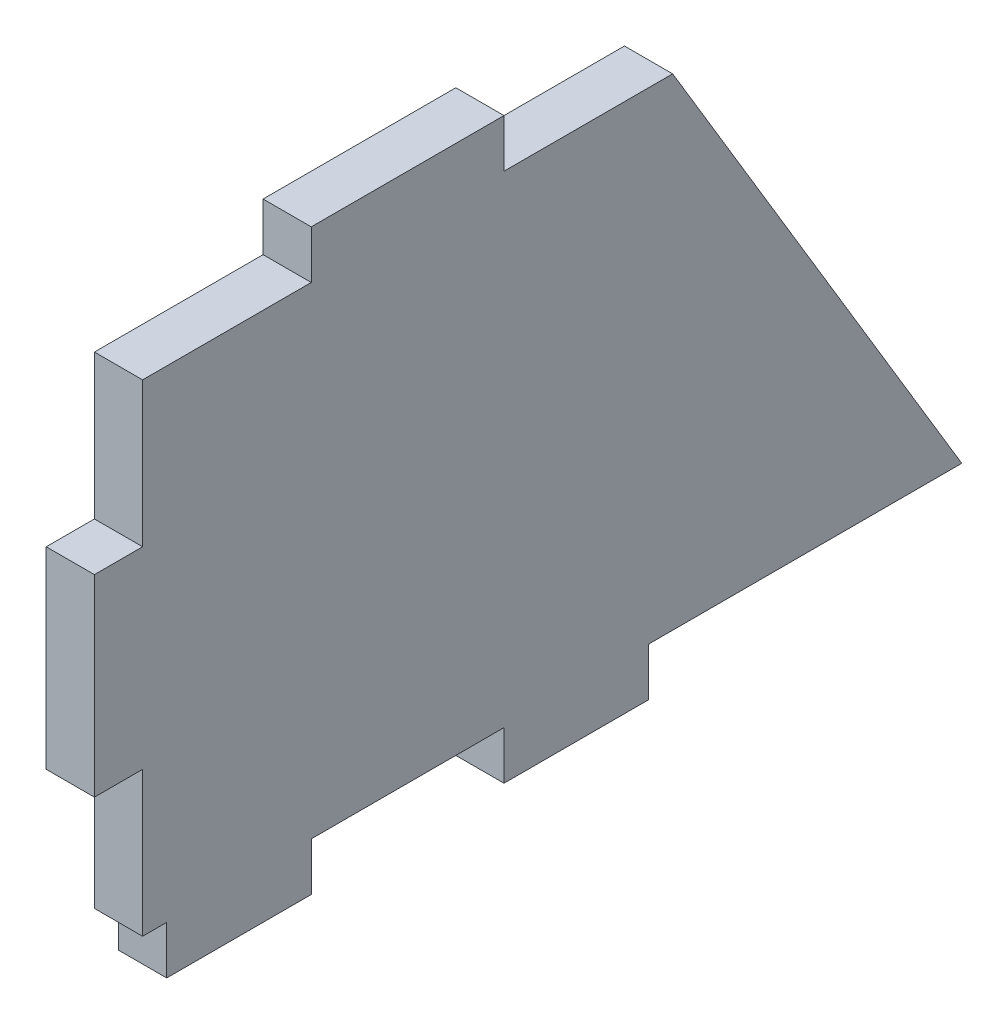
ISO-10303-21;
HEADER;
FILE_DESCRIPTION(('STEP AP214'),'2;1');
FILE_NAME('part.step','',(''),(''),'','','');
FILE_SCHEMA(('AUTOMOTIVE_DESIGN { 1 0 10303 214 1 1 1 1 }'));
ENDSEC;
DATA;
#1=APPLICATION_CONTEXT('core data for automotive mechanical design processes');
#2=APPLICATION_PROTOCOL_DEFINITION('international standard','automotive_design',2000,#1);
#3=PRODUCT_CONTEXT('',#1,'mechanical');
#4=PRODUCT('Part','Part','',(#3));
#5=PRODUCT_RELATED_PRODUCT_CATEGORY('part','',(#4));
#6=PRODUCT_DEFINITION_FORMATION('','',#4);
#7=PRODUCT_DEFINITION_CONTEXT('part definition',#1,'design');
#8=PRODUCT_DEFINITION('design','',#6,#7);
#9=PRODUCT_DEFINITION_SHAPE('','',#8);
#10=(LENGTH_UNIT() NAMED_UNIT(*) SI_UNIT(.MILLI.,.METRE.));
#11=(NAMED_UNIT(*) PLANE_ANGLE_UNIT() SI_UNIT($,.RADIAN.));
#12=(NAMED_UNIT(*) SI_UNIT($,.STERADIAN.) SOLID_ANGLE_UNIT());
#13=UNCERTAINTY_MEASURE_WITH_UNIT(LENGTH_MEASURE(1.E-05),#10,'distance_accuracy_value','');
#14=(GEOMETRIC_REPRESENTATION_CONTEXT(3) GLOBAL_UNCERTAINTY_ASSIGNED_CONTEXT((#13)) GLOBAL_UNIT_ASSIGNED_CONTEXT((#10,
#11,#12)) REPRESENTATION_CONTEXT('',''));
#15=CARTESIAN_POINT('',(0.,0.,0.));
#16=DIRECTION('',(0.,0.,1.));
#17=DIRECTION('',(1.,0.,0.));
#18=AXIS2_PLACEMENT_3D('',#15,#16,#17);
#19=CARTESIAN_POINT('',(5.,-55.,-17.5));
#20=DIRECTION('',(0.,0.,1.));
#21=DIRECTION('',(1.,0.,0.));
#22=AXIS2_PLACEMENT_3D('',#19,#20,#21);
#23=PLANE('',#22);
#24=DIRECTION('',(0.,1.,0.));
#25=VECTOR('',#24,1.);
#26=CARTESIAN_POINT('',(0.,-55.,-17.5));
#27=LINE('',#26,#25);
#28=CARTESIAN_POINT('',(0.,-55.,-17.5));
#29=VERTEX_POINT('',#28);
#30=CARTESIAN_POINT('',(0.,-50.,-17.5));
#31=VERTEX_POINT('',#30);
#32=EDGE_CURVE('E254',#29,#31,#27,.T.);
#33=ORIENTED_EDGE('',*,*,#32,.T.);
#34=DIRECTION('',(-1.,0.,0.));
#35=VECTOR('',#34,1.);
#36=CARTESIAN_POINT('',(5.,-50.,-17.5));
#37=LINE('',#36,#35);
#38=CARTESIAN_POINT('',(5.,-50.,-17.5));
#39=VERTEX_POINT('',#38);
#40=EDGE_CURVE('E11',#39,#31,#37,.T.);
#41=ORIENTED_EDGE('',*,*,#40,.F.);
#42=DIRECTION('',(0.,1.,0.));
#43=VECTOR('',#42,1.);
#44=CARTESIAN_POINT('',(5.,-55.,-17.5));
#45=LINE('',#44,#43);
#46=CARTESIAN_POINT('',(5.,-55.,-17.5));
#47=VERTEX_POINT('',#46);
#48=EDGE_CURVE('E312',#47,#39,#45,.T.);
#49=ORIENTED_EDGE('',*,*,#48,.F.);
#50=DIRECTION('',(-1.,0.,0.));
#51=VECTOR('',#50,1.);
#52=CARTESIAN_POINT('',(5.,-55.,-17.5));
#53=LINE('',#52,#51);
#54=EDGE_CURVE('E250',#47,#29,#53,.T.);
#55=ORIENTED_EDGE('',*,*,#54,.T.);
#56=EDGE_LOOP('',(#33,#41,#49,#55));
#57=FACE_BOUND('',#56,.T.);
#58=ADVANCED_FACE('F41',(#57),#23,.F.);
#59=CARTESIAN_POINT('',(5.,-50.,-17.5));
#60=DIRECTION('',(0.,1.,0.));
#61=DIRECTION('',(0.,0.,1.));
#62=AXIS2_PLACEMENT_3D('',#59,#60,#61);
#63=PLANE('',#62);
#64=DIRECTION('',(0.,0.,-1.));
#65=VECTOR('',#64,1.);
#66=CARTESIAN_POINT('',(0.,-50.,-17.5));
#67=LINE('',#66,#65);
#68=CARTESIAN_POINT('',(0.,-50.,-37.5));
#69=VERTEX_POINT('',#68);
#70=EDGE_CURVE('E258',#31,#69,#67,.T.);
#71=ORIENTED_EDGE('',*,*,#70,.T.);
#72=DIRECTION('',(-1.,0.,0.));
#73=VECTOR('',#72,1.);
#74=CARTESIAN_POINT('',(5.,-50.,-37.5));
#75=LINE('',#74,#73);
#76=CARTESIAN_POINT('',(5.,-50.,-37.5));
#77=VERTEX_POINT('',#76);
#78=EDGE_CURVE('E50',#77,#69,#75,.T.);
#79=ORIENTED_EDGE('',*,*,#78,.F.);
#80=DIRECTION('',(0.,0.,-1.));
#81=VECTOR('',#80,1.);
#82=CARTESIAN_POINT('',(5.,-50.,-17.5));
#83=LINE('',#82,#81);
#84=EDGE_CURVE('E161',#39,#77,#83,.T.);
#85=ORIENTED_EDGE('',*,*,#84,.F.);
#86=ORIENTED_EDGE('',*,*,#40,.T.);
#87=EDGE_LOOP('',(#71,#79,#85,#86));
#88=FACE_BOUND('',#87,.T.);
#89=ADVANCED_FACE('F462',(#88),#63,.F.);
#90=CARTESIAN_POINT('',(5.,-50.,-37.5));
#91=DIRECTION('',(0.,0.,-1.));
#92=DIRECTION('',(-1.,0.,0.));
#93=AXIS2_PLACEMENT_3D('',#90,#91,#92);
#94=PLANE('',#93);
#95=DIRECTION('',(0.,-1.,0.));
#96=VECTOR('',#95,1.);
#97=CARTESIAN_POINT('',(0.,-50.,-37.5));
#98=LINE('',#97,#96);
#99=CARTESIAN_POINT('',(0.,-55.,-37.5));
#100=VERTEX_POINT('',#99);
#101=EDGE_CURVE('E261',#69,#100,#98,.T.);
#102=ORIENTED_EDGE('',*,*,#101,.T.);
#103=DIRECTION('',(-1.,0.,0.));
#104=VECTOR('',#103,1.);
#105=CARTESIAN_POINT('',(5.,-55.,-37.5));
#106=LINE('',#105,#104);
#107=CARTESIAN_POINT('',(5.,-55.,-37.5));
#108=VERTEX_POINT('',#107);
#109=EDGE_CURVE('E371',#108,#100,#106,.T.);
#110=ORIENTED_EDGE('',*,*,#109,.F.);
#111=DIRECTION('',(0.,-1.,0.));
#112=VECTOR('',#111,1.);
#113=CARTESIAN_POINT('',(5.,-50.,-37.5));
#114=LINE('',#113,#112);
#115=EDGE_CURVE('E381',#77,#108,#114,.T.);
#116=ORIENTED_EDGE('',*,*,#115,.F.);
#117=ORIENTED_EDGE('',*,*,#78,.T.);
#118=EDGE_LOOP('',(#102,#110,#116,#117));
#119=FACE_BOUND('',#118,.T.);
#120=ADVANCED_FACE('F379',(#119),#94,.F.);
#121=CARTESIAN_POINT('',(5.,-55.,-37.5));
#122=DIRECTION('',(0.,1.,0.));
#123=DIRECTION('',(0.,0.,1.));
#124=AXIS2_PLACEMENT_3D('',#121,#122,#123);
#125=PLANE('',#124);
#126=DIRECTION('',(0.,0.,-1.));
#127=VECTOR('',#126,1.);
#128=CARTESIAN_POINT('',(0.,-55.,-37.5));
#129=LINE('',#128,#127);
#130=CARTESIAN_POINT('',(0.,-55.,-52.5));
#131=VERTEX_POINT('',#130);
#132=EDGE_CURVE('E264',#100,#131,#129,.T.);
#133=ORIENTED_EDGE('',*,*,#132,.T.);
#134=DIRECTION('',(-1.,0.,0.));
#135=VECTOR('',#134,1.);
#136=CARTESIAN_POINT('',(5.,-55.,-52.5));
#137=LINE('',#136,#135);
#138=CARTESIAN_POINT('',(5.,-55.,-52.5));
#139=VERTEX_POINT('',#138);
#140=EDGE_CURVE('E367',#139,#131,#137,.T.);
#141=ORIENTED_EDGE('',*,*,#140,.F.);
#142=DIRECTION('',(0.,0.,-1.));
#143=VECTOR('',#142,1.);
#144=CARTESIAN_POINT('',(5.,-55.,-37.5));
#145=LINE('',#144,#143);
#146=EDGE_CURVE('E400',#108,#139,#145,.T.);
#147=ORIENTED_EDGE('',*,*,#146,.F.);
#148=ORIENTED_EDGE('',*,*,#109,.T.);
#149=EDGE_LOOP('',(#133,#141,#147,#148));
#150=FACE_BOUND('',#149,.T.);
#151=ADVANCED_FACE('F390',(#150),#125,.F.);
#152=CARTESIAN_POINT('',(5.,-55.,-52.5));
#153=DIRECTION('',(0.,0.,1.));
#154=DIRECTION('',(1.,0.,0.));
#155=AXIS2_PLACEMENT_3D('',#152,#153,#154);
#156=PLANE('',#155);
#157=DIRECTION('',(0.,1.,0.));
#158=VECTOR('',#157,1.);
#159=CARTESIAN_POINT('',(0.,-55.,-52.5));
#160=LINE('',#159,#158);
#161=CARTESIAN_POINT('',(0.,-50.,-52.5));
#162=VERTEX_POINT('',#161);
#163=EDGE_CURVE('E267',#131,#162,#160,.T.);
#164=ORIENTED_EDGE('',*,*,#163,.T.);
#165=DIRECTION('',(-1.,0.,0.));
#166=VECTOR('',#165,1.);
#167=CARTESIAN_POINT('',(5.,-50.,-52.5));
#168=LINE('',#167,#166);
#169=CARTESIAN_POINT('',(5.,-50.,-52.5));
#170=VERTEX_POINT('',#169);
#171=EDGE_CURVE('E363',#170,#162,#168,.T.);
#172=ORIENTED_EDGE('',*,*,#171,.F.);
#173=DIRECTION('',(0.,1.,0.));
#174=VECTOR('',#173,1.);
#175=CARTESIAN_POINT('',(5.,-55.,-52.5));
#176=LINE('',#175,#174);
#177=EDGE_CURVE('E396',#139,#170,#176,.T.);
#178=ORIENTED_EDGE('',*,*,#177,.F.);
#179=ORIENTED_EDGE('',*,*,#140,.T.);
#180=EDGE_LOOP('',(#164,#172,#178,#179));
#181=FACE_BOUND('',#180,.T.);
#182=ADVANCED_FACE('F394',(#181),#156,.F.);
#183=CARTESIAN_POINT('',(5.,-50.,-52.5));
#184=DIRECTION('',(0.,1.,0.));
#185=DIRECTION('',(0.,0.,1.));
#186=AXIS2_PLACEMENT_3D('',#183,#184,#185);
#187=PLANE('',#186);
#188=DIRECTION('',(0.,0.,-1.));
#189=VECTOR('',#188,1.);
#190=CARTESIAN_POINT('',(0.,-50.,-52.5));
#191=LINE('',#190,#189);
#192=CARTESIAN_POINT('',(0.,-50.,-85.));
#193=VERTEX_POINT('',#192);
#194=EDGE_CURVE('E270',#162,#193,#191,.T.);
#195=ORIENTED_EDGE('',*,*,#194,.T.);
#196=DIRECTION('',(-1.,0.,0.));
#197=VECTOR('',#196,1.);
#198=CARTESIAN_POINT('',(5.,-50.,-85.));
#199=LINE('',#198,#197);
#200=CARTESIAN_POINT('',(5.,-50.,-85.));
#201=VERTEX_POINT('',#200);
#202=EDGE_CURVE('E359',#201,#193,#199,.T.);
#203=ORIENTED_EDGE('',*,*,#202,.F.);
#204=DIRECTION('',(0.,0.,-1.));
#205=VECTOR('',#204,1.);
#206=CARTESIAN_POINT('',(5.,-50.,-52.5));
#207=LINE('',#206,#205);
#208=EDGE_CURVE('E399',#170,#201,#207,.T.);
#209=ORIENTED_EDGE('',*,*,#208,.F.);
#210=ORIENTED_EDGE('',*,*,#171,.T.);
#211=EDGE_LOOP('',(#195,#203,#209,#210));
#212=FACE_BOUND('',#211,.T.);
#213=ADVANCED_FACE('F475',(#212),#187,.F.);
#214=CARTESIAN_POINT('',(5.,0.,-55.));
#215=DIRECTION('',(0.,-0.514495755427526,0.857492925712544));
#216=DIRECTION('',(0.,-0.857492925712544,-0.514495755427526));
#217=AXIS2_PLACEMENT_3D('',#214,#215,#216);
#218=PLANE('',#217);
#219=DIRECTION('',(0.,0.857492925712544,0.514495755427526));
#220=VECTOR('',#219,1.);
#221=CARTESIAN_POINT('',(0.,0.,-55.));
#222=LINE('',#221,#220);
#223=CARTESIAN_POINT('',(0.,0.,-55.));
#224=VERTEX_POINT('',#223);
#225=EDGE_CURVE('E273',#193,#224,#222,.T.);
#226=ORIENTED_EDGE('',*,*,#225,.T.);
#227=DIRECTION('',(-1.,0.,0.));
#228=VECTOR('',#227,1.);
#229=CARTESIAN_POINT('',(5.,0.,-55.));
#230=LINE('',#229,#228);
#231=CARTESIAN_POINT('',(5.,0.,-55.));
#232=VERTEX_POINT('',#231);
#233=EDGE_CURVE('E355',#232,#224,#230,.T.);
#234=ORIENTED_EDGE('',*,*,#233,.F.);
#235=DIRECTION('',(0.,0.857492925712544,0.514495755427526));
#236=VECTOR('',#235,1.);
#237=CARTESIAN_POINT('',(5.,0.,-55.));
#238=LINE('',#237,#236);
#239=EDGE_CURVE('E404',#201,#232,#238,.T.);
#240=ORIENTED_EDGE('',*,*,#239,.F.);
#241=ORIENTED_EDGE('',*,*,#202,.T.);
#242=EDGE_LOOP('',(#226,#234,#240,#241));
#243=FACE_BOUND('',#242,.T.);
#244=ADVANCED_FACE('F478',(#243),#218,.F.);
#245=CARTESIAN_POINT('',(5.,0.,-37.5));
#246=DIRECTION('',(0.,-1.,0.));
#247=DIRECTION('',(0.,0.,-1.));
#248=AXIS2_PLACEMENT_3D('',#245,#246,#247);
#249=PLANE('',#248);
#250=DIRECTION('',(0.,0.,1.));
#251=VECTOR('',#250,1.);
#252=CARTESIAN_POINT('',(0.,0.,-37.5));
#253=LINE('',#252,#251);
#254=CARTESIAN_POINT('',(0.,0.,-37.5));
#255=VERTEX_POINT('',#254);
#256=EDGE_CURVE('E276',#224,#255,#253,.T.);
#257=ORIENTED_EDGE('',*,*,#256,.T.);
#258=DIRECTION('',(-1.,0.,0.));
#259=VECTOR('',#258,1.);
#260=CARTESIAN_POINT('',(5.,0.,-37.5));
#261=LINE('',#260,#259);
#262=CARTESIAN_POINT('',(5.,0.,-37.5));
#263=VERTEX_POINT('',#262);
#264=EDGE_CURVE('E351',#263,#255,#261,.T.);
#265=ORIENTED_EDGE('',*,*,#264,.F.);
#266=DIRECTION('',(0.,0.,1.));
#267=VECTOR('',#266,1.);
#268=CARTESIAN_POINT('',(5.,0.,-37.5));
#269=LINE('',#268,#267);
#270=EDGE_CURVE('E411',#232,#263,#269,.T.);
#271=ORIENTED_EDGE('',*,*,#270,.F.);
#272=ORIENTED_EDGE('',*,*,#233,.T.);
#273=EDGE_LOOP('',(#257,#265,#271,#272));
#274=FACE_BOUND('',#273,.T.);
#275=ADVANCED_FACE('F482',(#274),#249,.F.);
#276=CARTESIAN_POINT('',(5.,5.,-37.5));
#277=DIRECTION('',(0.,0.,1.));
#278=DIRECTION('',(1.,0.,0.));
#279=AXIS2_PLACEMENT_3D('',#276,#277,#278);
#280=PLANE('',#279);
#281=DIRECTION('',(0.,1.,0.));
#282=VECTOR('',#281,1.);
#283=CARTESIAN_POINT('',(0.,5.,-37.5));
#284=LINE('',#283,#282);
#285=CARTESIAN_POINT('',(0.,5.,-37.5));
#286=VERTEX_POINT('',#285);
#287=EDGE_CURVE('E279',#255,#286,#284,.T.);
#288=ORIENTED_EDGE('',*,*,#287,.T.);
#289=DIRECTION('',(-1.,0.,0.));
#290=VECTOR('',#289,1.);
#291=CARTESIAN_POINT('',(5.,5.,-37.5));
#292=LINE('',#291,#290);
#293=CARTESIAN_POINT('',(5.,5.,-37.5));
#294=VERTEX_POINT('',#293);
#295=EDGE_CURVE('E347',#294,#286,#292,.T.);
#296=ORIENTED_EDGE('',*,*,#295,.F.);
#297=DIRECTION('',(0.,1.,0.));
#298=VECTOR('',#297,1.);
#299=CARTESIAN_POINT('',(5.,5.,-37.5));
#300=LINE('',#299,#298);
#301=EDGE_CURVE('E414',#263,#294,#300,.T.);
#302=ORIENTED_EDGE('',*,*,#301,.F.);
#303=ORIENTED_EDGE('',*,*,#264,.T.);
#304=EDGE_LOOP('',(#288,#296,#302,#303));
#305=FACE_BOUND('',#304,.T.);
#306=ADVANCED_FACE('F486',(#305),#280,.F.);
#307=CARTESIAN_POINT('',(5.,5.,-17.5));
#308=DIRECTION('',(0.,-1.,0.));
#309=DIRECTION('',(0.,0.,-1.));
#310=AXIS2_PLACEMENT_3D('',#307,#308,#309);
#311=PLANE('',#310);
#312=DIRECTION('',(0.,0.,1.));
#313=VECTOR('',#312,1.);
#314=CARTESIAN_POINT('',(0.,5.,-17.5));
#315=LINE('',#314,#313);
#316=CARTESIAN_POINT('',(0.,5.,-17.5));
#317=VERTEX_POINT('',#316);
#318=EDGE_CURVE('E282',#286,#317,#315,.T.);
#319=ORIENTED_EDGE('',*,*,#318,.T.);
#320=DIRECTION('',(-1.,0.,0.));
#321=VECTOR('',#320,1.);
#322=CARTESIAN_POINT('',(5.,5.,-17.5));
#323=LINE('',#322,#321);
#324=CARTESIAN_POINT('',(5.,5.,-17.5));
#325=VERTEX_POINT('',#324);
#326=EDGE_CURVE('E343',#325,#317,#323,.T.);
#327=ORIENTED_EDGE('',*,*,#326,.F.);
#328=DIRECTION('',(0.,0.,1.));
#329=VECTOR('',#328,1.);
#330=CARTESIAN_POINT('',(5.,5.,-17.5));
#331=LINE('',#330,#329);
#332=EDGE_CURVE('E417',#294,#325,#331,.T.);
#333=ORIENTED_EDGE('',*,*,#332,.F.);
#334=ORIENTED_EDGE('',*,*,#295,.T.);
#335=EDGE_LOOP('',(#319,#327,#333,#334));
#336=FACE_BOUND('',#335,.T.);
#337=ADVANCED_FACE('F490',(#336),#311,.F.);
#338=CARTESIAN_POINT('',(5.,0.,-17.5));
#339=DIRECTION('',(0.,0.,-1.));
#340=DIRECTION('',(0.,1.,0.));
#341=AXIS2_PLACEMENT_3D('',#338,#339,#340);
#342=PLANE('',#341);
#343=DIRECTION('',(0.,-1.,0.));
#344=VECTOR('',#343,1.);
#345=CARTESIAN_POINT('',(0.,0.,-17.5));
#346=LINE('',#345,#344);
#347=CARTESIAN_POINT('',(0.,0.,-17.5));
#348=VERTEX_POINT('',#347);
#349=EDGE_CURVE('E285',#317,#348,#346,.T.);
#350=ORIENTED_EDGE('',*,*,#349,.T.);
#351=DIRECTION('',(-1.,0.,0.));
#352=VECTOR('',#351,1.);
#353=CARTESIAN_POINT('',(5.,0.,-17.5));
#354=LINE('',#353,#352);
#355=CARTESIAN_POINT('',(5.,0.,-17.5));
#356=VERTEX_POINT('',#355);
#357=EDGE_CURVE('E339',#356,#348,#354,.T.);
#358=ORIENTED_EDGE('',*,*,#357,.F.);
#359=DIRECTION('',(0.,-1.,0.));
#360=VECTOR('',#359,1.);
#361=CARTESIAN_POINT('',(5.,0.,-17.5));
#362=LINE('',#361,#360);
#363=EDGE_CURVE('E420',#325,#356,#362,.T.);
#364=ORIENTED_EDGE('',*,*,#363,.F.);
#365=ORIENTED_EDGE('',*,*,#326,.T.);
#366=EDGE_LOOP('',(#350,#358,#364,#365));
#367=FACE_BOUND('',#366,.T.);
#368=ADVANCED_FACE('F494',(#367),#342,.F.);
#369=CARTESIAN_POINT('',(5.,0.,0.));
#370=DIRECTION('',(0.,-1.,0.));
#371=DIRECTION('',(0.,0.,-1.));
#372=AXIS2_PLACEMENT_3D('',#369,#370,#371);
#373=PLANE('',#372);
#374=DIRECTION('',(0.,0.,1.));
#375=VECTOR('',#374,1.);
#376=CARTESIAN_POINT('',(0.,0.,0.));
#377=LINE('',#376,#375);
#378=CARTESIAN_POINT('',(0.,0.,0.));
#379=VERTEX_POINT('',#378);
#380=EDGE_CURVE('E288',#348,#379,#377,.T.);
#381=ORIENTED_EDGE('',*,*,#380,.T.);
#382=DIRECTION('',(-1.,0.,0.));
#383=VECTOR('',#382,1.);
#384=CARTESIAN_POINT('',(5.,0.,0.));
#385=LINE('',#384,#383);
#386=CARTESIAN_POINT('',(5.,0.,0.));
#387=VERTEX_POINT('',#386);
#388=EDGE_CURVE('E335',#387,#379,#385,.T.);
#389=ORIENTED_EDGE('',*,*,#388,.F.);
#390=DIRECTION('',(0.,0.,1.));
#391=VECTOR('',#390,1.);
#392=CARTESIAN_POINT('',(5.,0.,0.));
#393=LINE('',#392,#391);
#394=EDGE_CURVE('E423',#356,#387,#393,.T.);
#395=ORIENTED_EDGE('',*,*,#394,.F.);
#396=ORIENTED_EDGE('',*,*,#357,.T.);
#397=EDGE_LOOP('',(#381,#389,#395,#396));
#398=FACE_BOUND('',#397,.T.);
#399=ADVANCED_FACE('F498',(#398),#373,.F.);
#400=CARTESIAN_POINT('',(5.,0.,0.));
#401=DIRECTION('',(0.,0.,-1.));
#402=DIRECTION('',(0.,1.,0.));
#403=AXIS2_PLACEMENT_3D('',#400,#401,#402);
#404=PLANE('',#403);
#405=DIRECTION('',(0.,-1.,0.));
#406=VECTOR('',#405,1.);
#407=CARTESIAN_POINT('',(0.,0.,0.));
#408=LINE('',#407,#406);
#409=CARTESIAN_POINT('',(0.,-15.,0.));
#410=VERTEX_POINT('',#409);
#411=EDGE_CURVE('E291',#379,#410,#408,.T.);
#412=ORIENTED_EDGE('',*,*,#411,.T.);
#413=DIRECTION('',(-1.,0.,0.));
#414=VECTOR('',#413,1.);
#415=CARTESIAN_POINT('',(5.,-15.,0.));
#416=LINE('',#415,#414);
#417=CARTESIAN_POINT('',(5.,-15.,0.));
#418=VERTEX_POINT('',#417);
#419=EDGE_CURVE('E331',#418,#410,#416,.T.);
#420=ORIENTED_EDGE('',*,*,#419,.F.);
#421=DIRECTION('',(0.,-1.,0.));
#422=VECTOR('',#421,1.);
#423=CARTESIAN_POINT('',(5.,0.,0.));
#424=LINE('',#423,#422);
#425=EDGE_CURVE('E426',#387,#418,#424,.T.);
#426=ORIENTED_EDGE('',*,*,#425,.F.);
#427=ORIENTED_EDGE('',*,*,#388,.T.);
#428=EDGE_LOOP('',(#412,#420,#426,#427));
#429=FACE_BOUND('',#428,.T.);
#430=ADVANCED_FACE('F502',(#429),#404,.F.);
#431=CARTESIAN_POINT('',(5.,-15.,0.));
#432=DIRECTION('',(0.,-1.,0.));
#433=DIRECTION('',(0.,0.,-1.));
#434=AXIS2_PLACEMENT_3D('',#431,#432,#433);
#435=PLANE('',#434);
#436=DIRECTION('',(0.,0.,1.));
#437=VECTOR('',#436,1.);
#438=CARTESIAN_POINT('',(0.,-15.,0.));
#439=LINE('',#438,#437);
#440=CARTESIAN_POINT('',(0.,-15.,5.));
#441=VERTEX_POINT('',#440);
#442=EDGE_CURVE('E294',#410,#441,#439,.T.);
#443=ORIENTED_EDGE('',*,*,#442,.T.);
#444=DIRECTION('',(-1.,0.,0.));
#445=VECTOR('',#444,1.);
#446=CARTESIAN_POINT('',(5.,-15.,5.));
#447=LINE('',#446,#445);
#448=CARTESIAN_POINT('',(5.,-15.,5.));
#449=VERTEX_POINT('',#448);
#450=EDGE_CURVE('E327',#449,#441,#447,.T.);
#451=ORIENTED_EDGE('',*,*,#450,.F.);
#452=DIRECTION('',(0.,0.,1.));
#453=VECTOR('',#452,1.);
#454=CARTESIAN_POINT('',(5.,-15.,0.));
#455=LINE('',#454,#453);
#456=EDGE_CURVE('E429',#418,#449,#455,.T.);
#457=ORIENTED_EDGE('',*,*,#456,.F.);
#458=ORIENTED_EDGE('',*,*,#419,.T.);
#459=EDGE_LOOP('',(#443,#451,#457,#458));
#460=FACE_BOUND('',#459,.T.);
#461=ADVANCED_FACE('F506',(#460),#435,.F.);
#462=CARTESIAN_POINT('',(5.,-15.,5.));
#463=DIRECTION('',(0.,0.,-1.));
#464=DIRECTION('',(-1.,0.,0.));
#465=AXIS2_PLACEMENT_3D('',#462,#463,#464);
#466=PLANE('',#465);
#467=DIRECTION('',(0.,-1.,0.));
#468=VECTOR('',#467,1.);
#469=CARTESIAN_POINT('',(0.,-15.,5.));
#470=LINE('',#469,#468);
#471=CARTESIAN_POINT('',(0.,-35.,5.));
#472=VERTEX_POINT('',#471);
#473=EDGE_CURVE('E297',#441,#472,#470,.T.);
#474=ORIENTED_EDGE('',*,*,#473,.T.);
#475=DIRECTION('',(-1.,0.,0.));
#476=VECTOR('',#475,1.);
#477=CARTESIAN_POINT('',(5.,-35.,5.));
#478=LINE('',#477,#476);
#479=CARTESIAN_POINT('',(5.,-35.,5.));
#480=VERTEX_POINT('',#479);
#481=EDGE_CURVE('E323',#480,#472,#478,.T.);
#482=ORIENTED_EDGE('',*,*,#481,.F.);
#483=DIRECTION('',(0.,-1.,0.));
#484=VECTOR('',#483,1.);
#485=CARTESIAN_POINT('',(5.,-15.,5.));
#486=LINE('',#485,#484);
#487=EDGE_CURVE('E432',#449,#480,#486,.T.);
#488=ORIENTED_EDGE('',*,*,#487,.F.);
#489=ORIENTED_EDGE('',*,*,#450,.T.);
#490=EDGE_LOOP('',(#474,#482,#488,#489));
#491=FACE_BOUND('',#490,.T.);
#492=ADVANCED_FACE('F510',(#491),#466,.F.);
#493=CARTESIAN_POINT('',(5.,-35.,5.));
#494=DIRECTION('',(0.,1.,0.));
#495=DIRECTION('',(0.,0.,1.));
#496=AXIS2_PLACEMENT_3D('',#493,#494,#495);
#497=PLANE('',#496);
#498=DIRECTION('',(0.,0.,-1.));
#499=VECTOR('',#498,1.);
#500=CARTESIAN_POINT('',(0.,-35.,5.));
#501=LINE('',#500,#499);
#502=CARTESIAN_POINT('',(0.,-35.,0.));
#503=VERTEX_POINT('',#502);
#504=EDGE_CURVE('E300',#472,#503,#501,.T.);
#505=ORIENTED_EDGE('',*,*,#504,.T.);
#506=DIRECTION('',(-1.,0.,0.));
#507=VECTOR('',#506,1.);
#508=CARTESIAN_POINT('',(5.,-35.,0.));
#509=LINE('',#508,#507);
#510=CARTESIAN_POINT('',(5.,-35.,0.));
#511=VERTEX_POINT('',#510);
#512=EDGE_CURVE('E319',#511,#503,#509,.T.);
#513=ORIENTED_EDGE('',*,*,#512,.F.);
#514=DIRECTION('',(0.,0.,-1.));
#515=VECTOR('',#514,1.);
#516=CARTESIAN_POINT('',(5.,-35.,5.));
#517=LINE('',#516,#515);
#518=EDGE_CURVE('E435',#480,#511,#517,.T.);
#519=ORIENTED_EDGE('',*,*,#518,.F.);
#520=ORIENTED_EDGE('',*,*,#481,.T.);
#521=EDGE_LOOP('',(#505,#513,#519,#520));
#522=FACE_BOUND('',#521,.T.);
#523=ADVANCED_FACE('F443',(#522),#497,.F.);
#524=CARTESIAN_POINT('',(5.,-35.,0.));
#525=DIRECTION('',(0.,0.,-1.));
#526=DIRECTION('',(0.,1.,0.));
#527=AXIS2_PLACEMENT_3D('',#524,#525,#526);
#528=PLANE('',#527);
#529=DIRECTION('',(0.,-1.,0.));
#530=VECTOR('',#529,1.);
#531=CARTESIAN_POINT('',(0.,-35.,0.));
#532=LINE('',#531,#530);
#533=CARTESIAN_POINT('',(0.,-50.,0.));
#534=VERTEX_POINT('',#533);
#535=EDGE_CURVE('E303',#503,#534,#532,.T.);
#536=ORIENTED_EDGE('',*,*,#535,.T.);
#537=DIRECTION('',(-1.,0.,0.));
#538=VECTOR('',#537,1.);
#539=CARTESIAN_POINT('',(5.,-50.,0.));
#540=LINE('',#539,#538);
#541=CARTESIAN_POINT('',(5.,-50.,0.));
#542=VERTEX_POINT('',#541);
#543=EDGE_CURVE('E243',#542,#534,#540,.T.);
#544=ORIENTED_EDGE('',*,*,#543,.F.);
#545=DIRECTION('',(0.,-1.,0.));
#546=VECTOR('',#545,1.);
#547=CARTESIAN_POINT('',(5.,-35.,0.));
#548=LINE('',#547,#546);
#549=EDGE_CURVE('E232',#511,#542,#548,.T.);
#550=ORIENTED_EDGE('',*,*,#549,.F.);
#551=ORIENTED_EDGE('',*,*,#512,.T.);
#552=EDGE_LOOP('',(#536,#544,#550,#551));
#553=FACE_BOUND('',#552,.T.);
#554=ADVANCED_FACE('F447',(#553),#528,.F.);
#555=CARTESIAN_POINT('',(5.,-50.,0.));
#556=DIRECTION('',(0.,1.,0.));
#557=DIRECTION('',(0.,0.,1.));
#558=AXIS2_PLACEMENT_3D('',#555,#556,#557);
#559=PLANE('',#558);
#560=DIRECTION('',(0.,0.,-1.));
#561=VECTOR('',#560,1.);
#562=CARTESIAN_POINT('',(0.,-50.,0.));
#563=LINE('',#562,#561);
#564=CARTESIAN_POINT('',(0.,-50.,-2.5));
#565=VERTEX_POINT('',#564);
#566=EDGE_CURVE('E241',#534,#565,#563,.T.);
#567=ORIENTED_EDGE('',*,*,#566,.T.);
#568=DIRECTION('',(-1.,0.,0.));
#569=VECTOR('',#568,1.);
#570=CARTESIAN_POINT('',(5.,-50.,-2.5));
#571=LINE('',#570,#569);
#572=CARTESIAN_POINT('',(5.,-50.,-2.5));
#573=VERTEX_POINT('',#572);
#574=EDGE_CURVE('E238',#573,#565,#571,.T.);
#575=ORIENTED_EDGE('',*,*,#574,.F.);
#576=DIRECTION('',(0.,0.,-1.));
#577=VECTOR('',#576,1.);
#578=CARTESIAN_POINT('',(5.,-50.,0.));
#579=LINE('',#578,#577);
#580=EDGE_CURVE('E226',#542,#573,#579,.T.);
#581=ORIENTED_EDGE('',*,*,#580,.F.);
#582=ORIENTED_EDGE('',*,*,#543,.T.);
#583=EDGE_LOOP('',(#567,#575,#581,#582));
#584=FACE_BOUND('',#583,.T.);
#585=ADVANCED_FACE('F239',(#584),#559,.F.);
#586=CARTESIAN_POINT('',(5.,-50.,-2.5));
#587=DIRECTION('',(0.,0.,-1.));
#588=DIRECTION('',(0.,1.,0.));
#589=AXIS2_PLACEMENT_3D('',#586,#587,#588);
#590=PLANE('',#589);
#591=DIRECTION('',(0.,-1.,0.));
#592=VECTOR('',#591,1.);
#593=CARTESIAN_POINT('',(0.,-50.,-2.5));
#594=LINE('',#593,#592);
#595=CARTESIAN_POINT('',(0.,-55.,-2.5));
#596=VERTEX_POINT('',#595);
#597=EDGE_CURVE('E145',#565,#596,#594,.T.);
#598=ORIENTED_EDGE('',*,*,#597,.T.);
#599=DIRECTION('',(-1.,0.,0.));
#600=VECTOR('',#599,1.);
#601=CARTESIAN_POINT('',(5.,-55.,-2.5));
#602=LINE('',#601,#600);
#603=CARTESIAN_POINT('',(5.,-55.,-2.5));
#604=VERTEX_POINT('',#603);
#605=EDGE_CURVE('E244',#604,#596,#602,.T.);
#606=ORIENTED_EDGE('',*,*,#605,.F.);
#607=DIRECTION('',(0.,-1.,0.));
#608=VECTOR('',#607,1.);
#609=CARTESIAN_POINT('',(5.,-50.,-2.5));
#610=LINE('',#609,#608);
#611=EDGE_CURVE('E230',#573,#604,#610,.T.);
#612=ORIENTED_EDGE('',*,*,#611,.F.);
#613=ORIENTED_EDGE('',*,*,#574,.T.);
#614=EDGE_LOOP('',(#598,#606,#612,#613));
#615=FACE_BOUND('',#614,.T.);
#616=ADVANCED_FACE('F246',(#615),#590,.F.);
#617=CARTESIAN_POINT('',(5.,-55.,-2.5));
#618=DIRECTION('',(0.,1.,0.));
#619=DIRECTION('',(0.,0.,1.));
#620=AXIS2_PLACEMENT_3D('',#617,#618,#619);
#621=PLANE('',#620);
#622=DIRECTION('',(0.,0.,-1.));
#623=VECTOR('',#622,1.);
#624=CARTESIAN_POINT('',(0.,-55.,-2.5));
#625=LINE('',#624,#623);
#626=EDGE_CURVE('E153',#596,#29,#625,.T.);
#627=ORIENTED_EDGE('',*,*,#626,.T.);
#628=ORIENTED_EDGE('',*,*,#54,.F.);
#629=DIRECTION('',(0.,0.,-1.));
#630=VECTOR('',#629,1.);
#631=CARTESIAN_POINT('',(5.,-55.,-2.5));
#632=LINE('',#631,#630);
#633=EDGE_CURVE('E61',#604,#47,#632,.T.);
#634=ORIENTED_EDGE('',*,*,#633,.F.);
#635=ORIENTED_EDGE('',*,*,#605,.T.);
#636=EDGE_LOOP('',(#627,#628,#634,#635));
#637=FACE_BOUND('',#636,.T.);
#638=ADVANCED_FACE('F451',(#637),#621,.F.);
#639=CARTESIAN_POINT('',(5.,0.,0.));
#640=DIRECTION('',(-1.,0.,0.));
#641=DIRECTION('',(0.,0.,1.));
#642=AXIS2_PLACEMENT_3D('',#639,#640,#641);
#643=PLANE('',#642);
#644=ORIENTED_EDGE('',*,*,#48,.T.);
#645=ORIENTED_EDGE('',*,*,#84,.T.);
#646=ORIENTED_EDGE('',*,*,#115,.T.);
#647=ORIENTED_EDGE('',*,*,#146,.T.);
#648=ORIENTED_EDGE('',*,*,#177,.T.);
#649=ORIENTED_EDGE('',*,*,#208,.T.);
#650=ORIENTED_EDGE('',*,*,#239,.T.);
#651=ORIENTED_EDGE('',*,*,#270,.T.);
#652=ORIENTED_EDGE('',*,*,#301,.T.);
#653=ORIENTED_EDGE('',*,*,#332,.T.);
#654=ORIENTED_EDGE('',*,*,#363,.T.);
#655=ORIENTED_EDGE('',*,*,#394,.T.);
#656=ORIENTED_EDGE('',*,*,#425,.T.);
#657=ORIENTED_EDGE('',*,*,#456,.T.);
#658=ORIENTED_EDGE('',*,*,#487,.T.);
#659=ORIENTED_EDGE('',*,*,#518,.T.);
#660=ORIENTED_EDGE('',*,*,#549,.T.);
#661=ORIENTED_EDGE('',*,*,#580,.T.);
#662=ORIENTED_EDGE('',*,*,#611,.T.);
#663=ORIENTED_EDGE('',*,*,#633,.T.);
#664=EDGE_LOOP('',(#644,#645,#646,#647,#648,#649,#650,#651,#652,#653,#654,#655,#656,#657,#658,
#659,#660,#661,#662,#663));
#665=FACE_BOUND('',#664,.T.);
#666=ADVANCED_FACE('F228',(#665),#643,.F.);
#667=CARTESIAN_POINT('',(0.,0.,0.));
#668=DIRECTION('',(-1.,0.,0.));
#669=DIRECTION('',(0.,0.,1.));
#670=AXIS2_PLACEMENT_3D('',#667,#668,#669);
#671=PLANE('',#670);
#672=ORIENTED_EDGE('',*,*,#32,.F.);
#673=ORIENTED_EDGE('',*,*,#626,.F.);
#674=ORIENTED_EDGE('',*,*,#597,.F.);
#675=ORIENTED_EDGE('',*,*,#566,.F.);
#676=ORIENTED_EDGE('',*,*,#535,.F.);
#677=ORIENTED_EDGE('',*,*,#504,.F.);
#678=ORIENTED_EDGE('',*,*,#473,.F.);
#679=ORIENTED_EDGE('',*,*,#442,.F.);
#680=ORIENTED_EDGE('',*,*,#411,.F.);
#681=ORIENTED_EDGE('',*,*,#380,.F.);
#682=ORIENTED_EDGE('',*,*,#349,.F.);
#683=ORIENTED_EDGE('',*,*,#318,.F.);
#684=ORIENTED_EDGE('',*,*,#287,.F.);
#685=ORIENTED_EDGE('',*,*,#256,.F.);
#686=ORIENTED_EDGE('',*,*,#225,.F.);
#687=ORIENTED_EDGE('',*,*,#194,.F.);
#688=ORIENTED_EDGE('',*,*,#163,.F.);
#689=ORIENTED_EDGE('',*,*,#132,.F.);
#690=ORIENTED_EDGE('',*,*,#101,.F.);
#691=ORIENTED_EDGE('',*,*,#70,.F.);
#692=EDGE_LOOP('',(#672,#673,#674,#675,#676,#677,#678,#679,#680,#681,#682,#683,#684,#685,#686,
#687,#688,#689,#690,#691));
#693=FACE_BOUND('',#692,.T.);
#694=ADVANCED_FACE('F385',(#693),#671,.T.);
#695=CLOSED_SHELL('',(#58,#89,#120,#151,#182,#213,#244,#275,#306,#337,#368,#399,#430,#461,#492,
#523,#554,#585,#616,#638,#666,#694));
#696=MANIFOLD_SOLID_BREP('B2',#695);
#697=ADVANCED_BREP_SHAPE_REPRESENTATION('',(#18,#696),#14);
#698=SHAPE_DEFINITION_REPRESENTATION(#9,#697);
ENDSEC;
END-ISO-10303-21;
